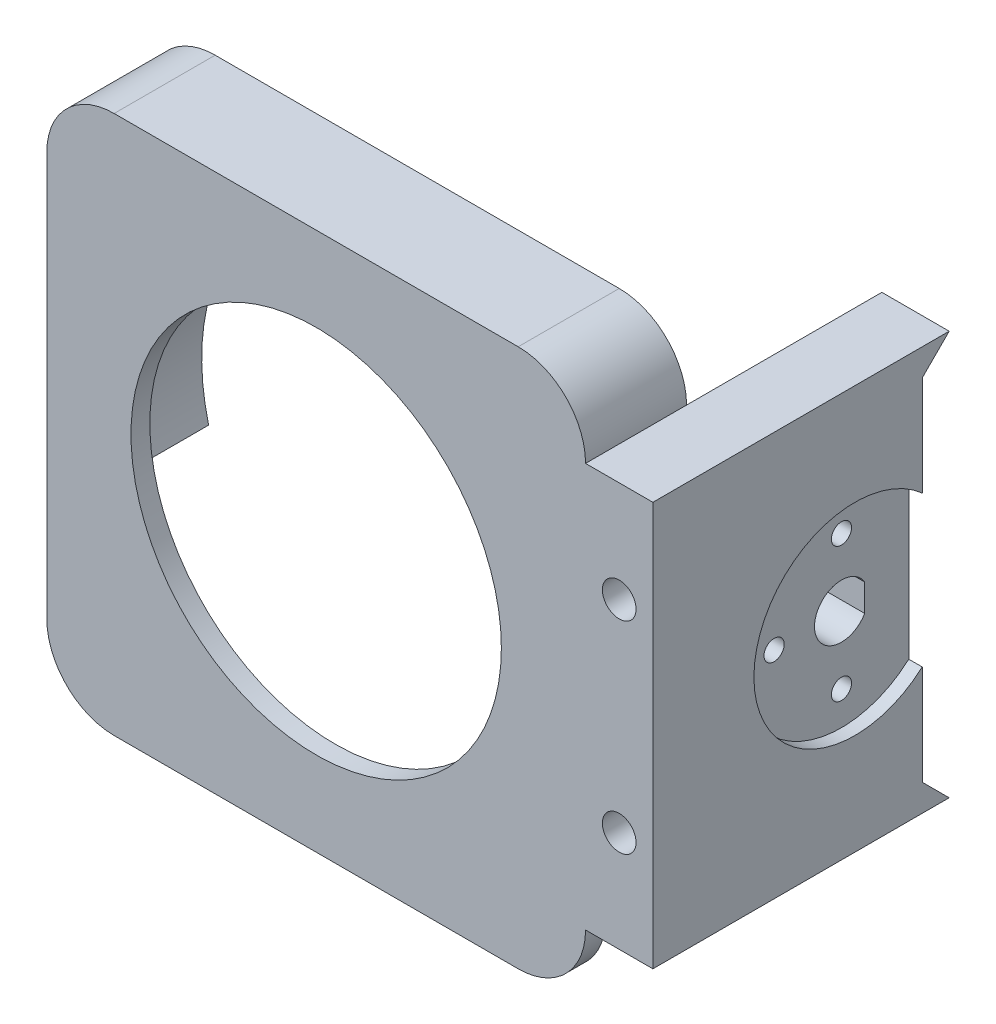
ISO-10303-21;
HEADER;
FILE_DESCRIPTION(('STEP AP214'),'2;1');
FILE_NAME('part.step','',(''),(''),'','','');
FILE_SCHEMA(('AUTOMOTIVE_DESIGN { 1 0 10303 214 1 1 1 1 }'));
ENDSEC;
DATA;
#1=APPLICATION_CONTEXT('core data for automotive mechanical design processes');
#2=APPLICATION_PROTOCOL_DEFINITION('international standard','automotive_design',2000,#1);
#3=PRODUCT_CONTEXT('',#1,'mechanical');
#4=PRODUCT('Part','Part','',(#3));
#5=PRODUCT_RELATED_PRODUCT_CATEGORY('part','',(#4));
#6=PRODUCT_DEFINITION_FORMATION('','',#4);
#7=PRODUCT_DEFINITION_CONTEXT('part definition',#1,'design');
#8=PRODUCT_DEFINITION('design','',#6,#7);
#9=PRODUCT_DEFINITION_SHAPE('','',#8);
#10=(LENGTH_UNIT() NAMED_UNIT(*) SI_UNIT(.MILLI.,.METRE.));
#11=(NAMED_UNIT(*) PLANE_ANGLE_UNIT() SI_UNIT($,.RADIAN.));
#12=(NAMED_UNIT(*) SI_UNIT($,.STERADIAN.) SOLID_ANGLE_UNIT());
#13=UNCERTAINTY_MEASURE_WITH_UNIT(LENGTH_MEASURE(1.E-05),#10,'distance_accuracy_value','');
#14=(GEOMETRIC_REPRESENTATION_CONTEXT(3) GLOBAL_UNCERTAINTY_ASSIGNED_CONTEXT((#13)) GLOBAL_UNIT_ASSIGNED_CONTEXT((#10,
#11,#12)) REPRESENTATION_CONTEXT('',''));
#15=CARTESIAN_POINT('',(0.,0.,0.));
#16=DIRECTION('',(0.,0.,1.));
#17=DIRECTION('',(1.,0.,0.));
#18=AXIS2_PLACEMENT_3D('',#15,#16,#17);
#19=CARTESIAN_POINT('',(0.,0.,0.));
#20=DIRECTION('',(0.,0.,-1.));
#21=DIRECTION('',(-1.,0.,0.));
#22=AXIS2_PLACEMENT_3D('',#19,#20,#21);
#23=PLANE('',#22);
#24=CARTESIAN_POINT('',(40.,40.,0.));
#25=DIRECTION('',(0.,0.,1.));
#26=DIRECTION('',(1.,0.,0.));
#27=AXIS2_PLACEMENT_3D('',#24,#25,#26);
#28=CIRCLE('',#27,32.);
#29=CARTESIAN_POINT('',(70.9677419354839,31.9378067861608,0.));
#30=VERTEX_POINT('',#29);
#31=CARTESIAN_POINT('',(9.03225806451613,31.9378067861608,0.));
#32=VERTEX_POINT('',#31);
#33=EDGE_CURVE('E356',#30,#32,#28,.T.);
#34=ORIENTED_EDGE('',*,*,#33,.T.);
#35=DIRECTION('',(-1.,0.,0.));
#36=VECTOR('',#35,1.);
#37=CARTESIAN_POINT('',(0.,31.9378067861608,0.));
#38=LINE('',#37,#36);
#39=CARTESIAN_POINT('',(0.,31.9378067861608,0.));
#40=VERTEX_POINT('',#39);
#41=EDGE_CURVE('E191',#32,#40,#38,.T.);
#42=ORIENTED_EDGE('',*,*,#41,.T.);
#43=DIRECTION('',(0.,-1.,0.));
#44=VECTOR('',#43,1.);
#45=CARTESIAN_POINT('',(0.,0.,0.));
#46=LINE('',#45,#44);
#47=CARTESIAN_POINT('',(0.,70.,0.));
#48=VERTEX_POINT('',#47);
#49=EDGE_CURVE('E359',#48,#40,#46,.T.);
#50=ORIENTED_EDGE('',*,*,#49,.F.);
#51=CARTESIAN_POINT('',(10.,70.,0.));
#52=DIRECTION('',(0.,0.,-1.));
#53=DIRECTION('',(-1.,0.,0.));
#54=AXIS2_PLACEMENT_3D('',#51,#52,#53);
#55=CIRCLE('',#54,10.);
#56=CARTESIAN_POINT('',(10.,80.,0.));
#57=VERTEX_POINT('',#56);
#58=EDGE_CURVE('E394',#48,#57,#55,.T.);
#59=ORIENTED_EDGE('',*,*,#58,.T.);
#60=DIRECTION('',(-1.,0.,0.));
#61=VECTOR('',#60,1.);
#62=CARTESIAN_POINT('',(0.,80.,0.));
#63=LINE('',#62,#61);
#64=CARTESIAN_POINT('',(70.,80.,0.));
#65=VERTEX_POINT('',#64);
#66=EDGE_CURVE('E365',#65,#57,#63,.T.);
#67=ORIENTED_EDGE('',*,*,#66,.F.);
#68=CARTESIAN_POINT('',(70.,70.,0.));
#69=DIRECTION('',(0.,0.,-1.));
#70=DIRECTION('',(-1.,0.,0.));
#71=AXIS2_PLACEMENT_3D('',#68,#69,#70);
#72=CIRCLE('',#71,10.);
#73=CARTESIAN_POINT('',(80.,70.,0.));
#74=VERTEX_POINT('',#73);
#75=EDGE_CURVE('E390',#65,#74,#72,.T.);
#76=ORIENTED_EDGE('',*,*,#75,.T.);
#77=DIRECTION('',(0.,1.,0.));
#78=VECTOR('',#77,1.);
#79=CARTESIAN_POINT('',(80.,0.,0.));
#80=LINE('',#79,#78);
#81=CARTESIAN_POINT('',(80.,31.9378067861608,0.));
#82=VERTEX_POINT('',#81);
#83=EDGE_CURVE('E377',#82,#74,#80,.T.);
#84=ORIENTED_EDGE('',*,*,#83,.F.);
#85=DIRECTION('',(1.,0.,0.));
#86=VECTOR('',#85,1.);
#87=CARTESIAN_POINT('',(0.,31.9378067861608,0.));
#88=LINE('',#87,#86);
#89=EDGE_CURVE('E548',#30,#82,#88,.T.);
#90=ORIENTED_EDGE('',*,*,#89,.F.);
#91=EDGE_LOOP('',(#34,#42,#50,#59,#67,#76,#84,#90));
#92=FACE_BOUND('',#91,.T.);
#93=ADVANCED_FACE('F41',(#92),#23,.T.);
#94=CARTESIAN_POINT('',(0.,0.,15.));
#95=DIRECTION('',(1.,0.,0.));
#96=DIRECTION('',(0.,0.,-1.));
#97=AXIS2_PLACEMENT_3D('',#94,#95,#96);
#98=PLANE('',#97);
#99=DIRECTION('',(0.,0.,-1.));
#100=VECTOR('',#99,1.);
#101=CARTESIAN_POINT('',(0.,31.9378067861608,12.));
#102=LINE('',#101,#100);
#103=CARTESIAN_POINT('',(0.,31.9378067861608,12.));
#104=VERTEX_POINT('',#103);
#105=EDGE_CURVE('E535',#104,#40,#102,.T.);
#106=ORIENTED_EDGE('',*,*,#105,.F.);
#107=DIRECTION('',(0.,1.,0.));
#108=VECTOR('',#107,1.);
#109=CARTESIAN_POINT('',(0.,0.,12.));
#110=LINE('',#109,#108);
#111=CARTESIAN_POINT('',(0.,9.99999999999993,12.));
#112=VERTEX_POINT('',#111);
#113=EDGE_CURVE('E202',#112,#104,#110,.T.);
#114=ORIENTED_EDGE('',*,*,#113,.F.);
#115=DIRECTION('',(0.,0.,-1.));
#116=VECTOR('',#115,1.);
#117=CARTESIAN_POINT('',(0.,10.,15.));
#118=LINE('',#117,#116);
#119=CARTESIAN_POINT('',(0.,10.,15.));
#120=VERTEX_POINT('',#119);
#121=EDGE_CURVE('E420',#112,#120,#118,.F.);
#122=ORIENTED_EDGE('',*,*,#121,.T.);
#123=DIRECTION('',(0.,-1.,0.));
#124=VECTOR('',#123,1.);
#125=CARTESIAN_POINT('',(0.,0.,15.));
#126=LINE('',#125,#124);
#127=CARTESIAN_POINT('',(0.,70.,15.));
#128=VERTEX_POINT('',#127);
#129=EDGE_CURVE('E360',#128,#120,#126,.T.);
#130=ORIENTED_EDGE('',*,*,#129,.F.);
#131=DIRECTION('',(0.,0.,-1.));
#132=VECTOR('',#131,1.);
#133=CARTESIAN_POINT('',(0.,70.,15.));
#134=LINE('',#133,#132);
#135=EDGE_CURVE('E416',#128,#48,#134,.T.);
#136=ORIENTED_EDGE('',*,*,#135,.T.);
#137=ORIENTED_EDGE('',*,*,#49,.T.);
#138=EDGE_LOOP('',(#106,#114,#122,#130,#136,#137));
#139=FACE_BOUND('',#138,.T.);
#140=ADVANCED_FACE('F462',(#139),#98,.F.);
#141=CARTESIAN_POINT('',(70.,10.,15.));
#142=DIRECTION('',(0.,0.,-1.));
#143=DIRECTION('',(-1.,0.,0.));
#144=AXIS2_PLACEMENT_3D('',#141,#142,#143);
#145=CYLINDRICAL_SURFACE('',#144,10.);
#146=DIRECTION('',(0.,0.,-1.));
#147=VECTOR('',#146,1.);
#148=CARTESIAN_POINT('',(70.,0.,15.));
#149=LINE('',#148,#147);
#150=CARTESIAN_POINT('',(70.,0.,12.));
#151=VERTEX_POINT('',#150);
#152=CARTESIAN_POINT('',(70.,0.,15.));
#153=VERTEX_POINT('',#152);
#154=EDGE_CURVE('E401',#151,#153,#149,.F.);
#155=ORIENTED_EDGE('',*,*,#154,.F.);
#156=CARTESIAN_POINT('',(70.,10.,12.));
#157=DIRECTION('',(0.,0.,-1.));
#158=DIRECTION('',(-1.,0.,0.));
#159=AXIS2_PLACEMENT_3D('',#156,#157,#158);
#160=CIRCLE('',#159,10.);
#161=CARTESIAN_POINT('',(80.,9.99999999999993,12.));
#162=VERTEX_POINT('',#161);
#163=EDGE_CURVE('E517',#151,#162,#160,.F.);
#164=ORIENTED_EDGE('',*,*,#163,.T.);
#165=DIRECTION('',(0.,0.,-1.));
#166=VECTOR('',#165,1.);
#167=CARTESIAN_POINT('',(80.,10.,15.));
#168=LINE('',#167,#166);
#169=CARTESIAN_POINT('',(80.,10.,15.));
#170=VERTEX_POINT('',#169);
#171=EDGE_CURVE('E386',#170,#162,#168,.T.);
#172=ORIENTED_EDGE('',*,*,#171,.F.);
#173=CARTESIAN_POINT('',(70.,10.,15.));
#174=DIRECTION('',(0.,0.,-1.));
#175=DIRECTION('',(-1.,0.,0.));
#176=AXIS2_PLACEMENT_3D('',#173,#174,#175);
#177=CIRCLE('',#176,10.);
#178=EDGE_CURVE('E413',#153,#170,#177,.F.);
#179=ORIENTED_EDGE('',*,*,#178,.F.);
#180=EDGE_LOOP('',(#155,#164,#172,#179));
#181=FACE_BOUND('',#180,.T.);
#182=ADVANCED_FACE('F468',(#181),#145,.T.);
#183=CARTESIAN_POINT('',(10.,10.,15.));
#184=DIRECTION('',(0.,0.,-1.));
#185=DIRECTION('',(-1.,0.,0.));
#186=AXIS2_PLACEMENT_3D('',#183,#184,#185);
#187=CYLINDRICAL_SURFACE('',#186,10.);
#188=ORIENTED_EDGE('',*,*,#121,.F.);
#189=CARTESIAN_POINT('',(10.,10.,12.));
#190=DIRECTION('',(0.,0.,1.));
#191=DIRECTION('',(1.,0.,0.));
#192=AXIS2_PLACEMENT_3D('',#189,#190,#191);
#193=CIRCLE('',#192,10.);
#194=CARTESIAN_POINT('',(10.,0.,12.));
#195=VERTEX_POINT('',#194);
#196=EDGE_CURVE('E11',#195,#112,#193,.F.);
#197=ORIENTED_EDGE('',*,*,#196,.F.);
#198=DIRECTION('',(0.,0.,-1.));
#199=VECTOR('',#198,1.);
#200=CARTESIAN_POINT('',(10.,0.,15.));
#201=LINE('',#200,#199);
#202=CARTESIAN_POINT('',(10.,0.,15.));
#203=VERTEX_POINT('',#202);
#204=EDGE_CURVE('E397',#203,#195,#201,.T.);
#205=ORIENTED_EDGE('',*,*,#204,.F.);
#206=CARTESIAN_POINT('',(10.,10.,15.));
#207=DIRECTION('',(0.,0.,-1.));
#208=DIRECTION('',(-1.,0.,0.));
#209=AXIS2_PLACEMENT_3D('',#206,#207,#208);
#210=CIRCLE('',#209,10.);
#211=EDGE_CURVE('E410',#120,#203,#210,.F.);
#212=ORIENTED_EDGE('',*,*,#211,.F.);
#213=EDGE_LOOP('',(#188,#197,#205,#212));
#214=FACE_BOUND('',#213,.T.);
#215=ADVANCED_FACE('F484',(#214),#187,.T.);
#216=CARTESIAN_POINT('',(80.,40.,-15.));
#217=DIRECTION('',(1.,0.,0.));
#218=DIRECTION('',(0.,0.,-1.));
#219=AXIS2_PLACEMENT_3D('',#216,#217,#218);
#220=CYLINDRICAL_SURFACE('',#219,4.);
#221=CARTESIAN_POINT('',(88.,40.,-15.));
#222=DIRECTION('',(1.,0.,0.));
#223=DIRECTION('',(0.,0.,-1.));
#224=AXIS2_PLACEMENT_3D('',#221,#222,#223);
#225=CIRCLE('',#224,4.);
#226=CARTESIAN_POINT('',(88.,37.9787216202429,-18.4517290901121));
#227=VERTEX_POINT('',#226);
#228=CARTESIAN_POINT('',(88.,42.0212783797572,-18.4517290901121));
#229=VERTEX_POINT('',#228);
#230=EDGE_CURVE('E233',#227,#229,#225,.F.);
#231=ORIENTED_EDGE('',*,*,#230,.F.);
#232=DIRECTION('',(1.,0.,0.));
#233=VECTOR('',#232,1.);
#234=CARTESIAN_POINT('',(80.,37.9787216202429,-18.4517290901121));
#235=LINE('',#234,#233);
#236=CARTESIAN_POINT('',(80.,37.9787216202429,-18.4517290901121));
#237=VERTEX_POINT('',#236);
#238=EDGE_CURVE('E255',#237,#227,#235,.T.);
#239=ORIENTED_EDGE('',*,*,#238,.F.);
#240=CARTESIAN_POINT('',(80.,40.,-15.));
#241=DIRECTION('',(1.,0.,0.));
#242=DIRECTION('',(0.,0.,-1.));
#243=AXIS2_PLACEMENT_3D('',#240,#241,#242);
#244=CIRCLE('',#243,4.);
#245=CARTESIAN_POINT('',(80.,42.0212783797572,-18.4517290901121));
#246=VERTEX_POINT('',#245);
#247=EDGE_CURVE('E246',#246,#237,#244,.T.);
#248=ORIENTED_EDGE('',*,*,#247,.F.);
#249=DIRECTION('',(1.,0.,0.));
#250=VECTOR('',#249,1.);
#251=CARTESIAN_POINT('',(80.,42.0212783797572,-18.4517290901121));
#252=LINE('',#251,#250);
#253=EDGE_CURVE('E256',#246,#229,#252,.T.);
#254=ORIENTED_EDGE('',*,*,#253,.T.);
#255=EDGE_LOOP('',(#231,#239,#248,#254));
#256=FACE_BOUND('',#255,.T.);
#257=ADVANCED_FACE('F487',(#256),#220,.F.);
#258=CARTESIAN_POINT('',(80.,42.0212783797572,-18.4517290901121));
#259=DIRECTION('',(0.,0.,-1.));
#260=DIRECTION('',(-1.,0.,0.));
#261=AXIS2_PLACEMENT_3D('',#258,#259,#260);
#262=PLANE('',#261);
#263=DIRECTION('',(0.,-1.,0.));
#264=VECTOR('',#263,1.);
#265=CARTESIAN_POINT('',(88.,42.0212783797572,-18.4517290901121));
#266=LINE('',#265,#264);
#267=EDGE_CURVE('E230',#229,#227,#266,.T.);
#268=ORIENTED_EDGE('',*,*,#267,.F.);
#269=ORIENTED_EDGE('',*,*,#253,.F.);
#270=DIRECTION('',(0.,1.,0.));
#271=VECTOR('',#270,1.);
#272=CARTESIAN_POINT('',(80.,42.0212783797572,-18.4517290901121));
#273=LINE('',#272,#271);
#274=EDGE_CURVE('E250',#237,#246,#273,.T.);
#275=ORIENTED_EDGE('',*,*,#274,.F.);
#276=ORIENTED_EDGE('',*,*,#238,.T.);
#277=EDGE_LOOP('',(#268,#269,#275,#276));
#278=FACE_BOUND('',#277,.T.);
#279=ADVANCED_FACE('F722',(#278),#262,.F.);
#280=CARTESIAN_POINT('',(60.,30.,-15.));
#281=DIRECTION('',(1.,0.,0.));
#282=DIRECTION('',(0.,0.,-1.));
#283=AXIS2_PLACEMENT_3D('',#280,#281,#282);
#284=CYLINDRICAL_SURFACE('',#283,1.5);
#285=CARTESIAN_POINT('',(80.,30.,-15.));
#286=DIRECTION('',(1.,0.,0.));
#287=DIRECTION('',(0.,0.,-1.));
#288=AXIS2_PLACEMENT_3D('',#285,#286,#287);
#289=CIRCLE('',#288,1.5);
#290=CARTESIAN_POINT('',(80.,30.,-16.5));
#291=VERTEX_POINT('',#290);
#292=EDGE_CURVE('E245',#291,#291,#289,.T.);
#293=ORIENTED_EDGE('',*,*,#292,.F.);
#294=EDGE_LOOP('',(#293));
#295=FACE_BOUND('',#294,.T.);
#296=CARTESIAN_POINT('',(88.,30.,-15.));
#297=DIRECTION('',(1.,0.,0.));
#298=DIRECTION('',(0.,0.,-1.));
#299=AXIS2_PLACEMENT_3D('',#296,#297,#298);
#300=CIRCLE('',#299,1.5);
#301=CARTESIAN_POINT('',(88.,30.,-16.5));
#302=VERTEX_POINT('',#301);
#303=EDGE_CURVE('E226',#302,#302,#300,.F.);
#304=ORIENTED_EDGE('',*,*,#303,.F.);
#305=EDGE_LOOP('',(#304));
#306=FACE_BOUND('',#305,.T.);
#307=ADVANCED_FACE('F456',(#295,#306),#284,.F.);
#308=CARTESIAN_POINT('',(60.,50.,-15.));
#309=DIRECTION('',(1.,0.,0.));
#310=DIRECTION('',(0.,0.,-1.));
#311=AXIS2_PLACEMENT_3D('',#308,#309,#310);
#312=CYLINDRICAL_SURFACE('',#311,1.5);
#313=CARTESIAN_POINT('',(80.,50.,-15.));
#314=DIRECTION('',(1.,0.,0.));
#315=DIRECTION('',(0.,0.,-1.));
#316=AXIS2_PLACEMENT_3D('',#313,#314,#315);
#317=CIRCLE('',#316,1.5);
#318=CARTESIAN_POINT('',(80.,50.,-16.5));
#319=VERTEX_POINT('',#318);
#320=EDGE_CURVE('E432',#319,#319,#317,.T.);
#321=ORIENTED_EDGE('',*,*,#320,.F.);
#322=EDGE_LOOP('',(#321));
#323=FACE_BOUND('',#322,.T.);
#324=CARTESIAN_POINT('',(88.,50.,-15.));
#325=DIRECTION('',(1.,0.,0.));
#326=DIRECTION('',(0.,0.,-1.));
#327=AXIS2_PLACEMENT_3D('',#324,#325,#326);
#328=CIRCLE('',#327,1.5);
#329=CARTESIAN_POINT('',(88.,50.,-16.5));
#330=VERTEX_POINT('',#329);
#331=EDGE_CURVE('E222',#330,#330,#328,.F.);
#332=ORIENTED_EDGE('',*,*,#331,.F.);
#333=EDGE_LOOP('',(#332));
#334=FACE_BOUND('',#333,.T.);
#335=ADVANCED_FACE('F447',(#323,#334),#312,.F.);
#336=CARTESIAN_POINT('',(60.,40.,-4.99999999999999));
#337=DIRECTION('',(1.,0.,0.));
#338=DIRECTION('',(0.,0.,-1.));
#339=AXIS2_PLACEMENT_3D('',#336,#337,#338);
#340=CYLINDRICAL_SURFACE('',#339,1.5);
#341=CARTESIAN_POINT('',(80.,40.,-4.99999999999999));
#342=DIRECTION('',(1.,0.,0.));
#343=DIRECTION('',(0.,0.,-1.));
#344=AXIS2_PLACEMENT_3D('',#341,#342,#343);
#345=CIRCLE('',#344,1.5);
#346=CARTESIAN_POINT('',(80.,40.,-6.49999999999999));
#347=VERTEX_POINT('',#346);
#348=EDGE_CURVE('E251',#347,#347,#345,.T.);
#349=ORIENTED_EDGE('',*,*,#348,.F.);
#350=EDGE_LOOP('',(#349));
#351=FACE_BOUND('',#350,.T.);
#352=CARTESIAN_POINT('',(88.,40.,-4.99999999999999));
#353=DIRECTION('',(1.,0.,0.));
#354=DIRECTION('',(0.,0.,-1.));
#355=AXIS2_PLACEMENT_3D('',#352,#353,#354);
#356=CIRCLE('',#355,1.5);
#357=CARTESIAN_POINT('',(88.,40.,-6.49999999999999));
#358=VERTEX_POINT('',#357);
#359=EDGE_CURVE('E220',#358,#358,#356,.F.);
#360=ORIENTED_EDGE('',*,*,#359,.F.);
#361=EDGE_LOOP('',(#360));
#362=FACE_BOUND('',#361,.T.);
#363=ADVANCED_FACE('F445',(#351,#362),#340,.F.);
#364=CARTESIAN_POINT('',(40.,40.,15.));
#365=DIRECTION('',(0.,0.,-1.));
#366=DIRECTION('',(-1.,0.,0.));
#367=AXIS2_PLACEMENT_3D('',#364,#365,#366);
#368=CYLINDRICAL_SURFACE('',#367,32.);
#369=DIRECTION('',(0.,0.,-1.));
#370=VECTOR('',#369,1.);
#371=CARTESIAN_POINT('',(70.9677419354839,31.9378067861608,12.));
#372=LINE('',#371,#370);
#373=CARTESIAN_POINT('',(70.9677419354839,31.9378067861608,12.));
#374=VERTEX_POINT('',#373);
#375=EDGE_CURVE('E209',#374,#30,#372,.T.);
#376=ORIENTED_EDGE('',*,*,#375,.F.);
#377=CARTESIAN_POINT('',(40.,40.,12.));
#378=DIRECTION('',(0.,0.,1.));
#379=DIRECTION('',(1.,0.,0.));
#380=AXIS2_PLACEMENT_3D('',#377,#378,#379);
#381=CIRCLE('',#380,32.);
#382=CARTESIAN_POINT('',(9.03225806451613,31.9378067861608,12.));
#383=VERTEX_POINT('',#382);
#384=EDGE_CURVE('E197',#383,#374,#381,.T.);
#385=ORIENTED_EDGE('',*,*,#384,.F.);
#386=DIRECTION('',(0.,0.,-1.));
#387=VECTOR('',#386,1.);
#388=CARTESIAN_POINT('',(9.03225806451613,31.9378067861608,12.));
#389=LINE('',#388,#387);
#390=EDGE_CURVE('E185',#383,#32,#389,.T.);
#391=ORIENTED_EDGE('',*,*,#390,.T.);
#392=ORIENTED_EDGE('',*,*,#33,.F.);
#393=EDGE_LOOP('',(#376,#385,#391,#392));
#394=FACE_BOUND('',#393,.T.);
#395=CARTESIAN_POINT('',(40.,40.,12.2));
#396=DIRECTION('',(0.,0.,1.));
#397=DIRECTION('',(1.,0.,0.));
#398=AXIS2_PLACEMENT_3D('',#395,#396,#397);
#399=CIRCLE('',#398,32.);
#400=CARTESIAN_POINT('',(72.,40.,12.2));
#401=VERTEX_POINT('',#400);
#402=EDGE_CURVE('E349',#401,#401,#399,.T.);
#403=ORIENTED_EDGE('',*,*,#402,.T.);
#404=EDGE_LOOP('',(#403));
#405=FACE_BOUND('',#404,.T.);
#406=ADVANCED_FACE('F207',(#394,#405),#368,.F.);
#407=CARTESIAN_POINT('',(0.,0.,15.));
#408=DIRECTION('',(0.,0.,-1.));
#409=DIRECTION('',(-1.,0.,0.));
#410=AXIS2_PLACEMENT_3D('',#407,#408,#409);
#411=PLANE('',#410);
#412=CARTESIAN_POINT('',(85.,55.,15.));
#413=DIRECTION('',(0.,0.,-1.));
#414=DIRECTION('',(0.,1.,0.));
#415=AXIS2_PLACEMENT_3D('',#412,#413,#414);
#416=CIRCLE('',#415,2.5);
#417=CARTESIAN_POINT('',(85.,57.5,15.));
#418=VERTEX_POINT('',#417);
#419=EDGE_CURVE('E296',#418,#418,#416,.T.);
#420=ORIENTED_EDGE('',*,*,#419,.T.);
#421=EDGE_LOOP('',(#420));
#422=FACE_BOUND('',#421,.T.);
#423=CARTESIAN_POINT('',(85.,25.,15.));
#424=DIRECTION('',(0.,0.,-1.));
#425=DIRECTION('',(0.,-1.,0.));
#426=AXIS2_PLACEMENT_3D('',#423,#424,#425);
#427=CIRCLE('',#426,2.5);
#428=CARTESIAN_POINT('',(85.,22.5,15.));
#429=VERTEX_POINT('',#428);
#430=EDGE_CURVE('E305',#429,#429,#427,.T.);
#431=ORIENTED_EDGE('',*,*,#430,.T.);
#432=EDGE_LOOP('',(#431));
#433=FACE_BOUND('',#432,.T.);
#434=DIRECTION('',(1.,0.,0.));
#435=VECTOR('',#434,1.);
#436=CARTESIAN_POINT('',(0.,0.,15.));
#437=LINE('',#436,#435);
#438=EDGE_CURVE('E364',#203,#153,#437,.T.);
#439=ORIENTED_EDGE('',*,*,#438,.T.);
#440=ORIENTED_EDGE('',*,*,#178,.T.);
#441=DIRECTION('',(-1.,0.,0.));
#442=VECTOR('',#441,1.);
#443=CARTESIAN_POINT('',(90.,10.,15.));
#444=LINE('',#443,#442);
#445=CARTESIAN_POINT('',(90.,10.,15.));
#446=VERTEX_POINT('',#445);
#447=EDGE_CURVE('E340',#446,#170,#444,.T.);
#448=ORIENTED_EDGE('',*,*,#447,.F.);
#449=DIRECTION('',(0.,-1.,0.));
#450=VECTOR('',#449,1.);
#451=CARTESIAN_POINT('',(90.,70.,15.));
#452=LINE('',#451,#450);
#453=CARTESIAN_POINT('',(90.,70.,15.));
#454=VERTEX_POINT('',#453);
#455=EDGE_CURVE('E312',#454,#446,#452,.T.);
#456=ORIENTED_EDGE('',*,*,#455,.F.);
#457=DIRECTION('',(-1.,0.,0.));
#458=VECTOR('',#457,1.);
#459=CARTESIAN_POINT('',(90.,70.,15.));
#460=LINE('',#459,#458);
#461=CARTESIAN_POINT('',(80.,70.,15.));
#462=VERTEX_POINT('',#461);
#463=EDGE_CURVE('E328',#454,#462,#460,.T.);
#464=ORIENTED_EDGE('',*,*,#463,.T.);
#465=CARTESIAN_POINT('',(70.,70.,15.));
#466=DIRECTION('',(0.,0.,-1.));
#467=DIRECTION('',(-1.,0.,0.));
#468=AXIS2_PLACEMENT_3D('',#465,#466,#467);
#469=CIRCLE('',#468,10.);
#470=CARTESIAN_POINT('',(70.,80.,15.));
#471=VERTEX_POINT('',#470);
#472=EDGE_CURVE('E404',#462,#471,#469,.F.);
#473=ORIENTED_EDGE('',*,*,#472,.T.);
#474=DIRECTION('',(-1.,0.,0.));
#475=VECTOR('',#474,1.);
#476=CARTESIAN_POINT('',(0.,80.,15.));
#477=LINE('',#476,#475);
#478=CARTESIAN_POINT('',(10.,80.,15.));
#479=VERTEX_POINT('',#478);
#480=EDGE_CURVE('E369',#471,#479,#477,.T.);
#481=ORIENTED_EDGE('',*,*,#480,.T.);
#482=CARTESIAN_POINT('',(10.,70.,15.));
#483=DIRECTION('',(0.,0.,-1.));
#484=DIRECTION('',(-1.,0.,0.));
#485=AXIS2_PLACEMENT_3D('',#482,#483,#484);
#486=CIRCLE('',#485,10.);
#487=EDGE_CURVE('E407',#479,#128,#486,.F.);
#488=ORIENTED_EDGE('',*,*,#487,.T.);
#489=ORIENTED_EDGE('',*,*,#129,.T.);
#490=ORIENTED_EDGE('',*,*,#211,.T.);
#491=EDGE_LOOP('',(#439,#440,#448,#456,#464,#473,#481,#488,#489,#490));
#492=FACE_BOUND('',#491,.T.);
#493=CARTESIAN_POINT('',(40.,40.,15.));
#494=DIRECTION('',(0.,0.,1.));
#495=DIRECTION('',(1.,0.,0.));
#496=AXIS2_PLACEMENT_3D('',#493,#494,#495);
#497=CIRCLE('',#496,27.5);
#498=CARTESIAN_POINT('',(67.5,40.,15.));
#499=VERTEX_POINT('',#498);
#500=EDGE_CURVE('E344',#499,#499,#497,.T.);
#501=ORIENTED_EDGE('',*,*,#500,.F.);
#502=EDGE_LOOP('',(#501));
#503=FACE_BOUND('',#502,.T.);
#504=ADVANCED_FACE('F454',(#422,#433,#492,#503),#411,.F.);
#505=CARTESIAN_POINT('',(0.,0.,15.));
#506=DIRECTION('',(0.,1.,0.));
#507=DIRECTION('',(0.,0.,1.));
#508=AXIS2_PLACEMENT_3D('',#505,#506,#507);
#509=PLANE('',#508);
#510=ORIENTED_EDGE('',*,*,#204,.T.);
#511=DIRECTION('',(-1.,0.,0.));
#512=VECTOR('',#511,1.);
#513=CARTESIAN_POINT('',(70.,0.,12.));
#514=LINE('',#513,#512);
#515=EDGE_CURVE('E56',#151,#195,#514,.T.);
#516=ORIENTED_EDGE('',*,*,#515,.F.);
#517=ORIENTED_EDGE('',*,*,#154,.T.);
#518=ORIENTED_EDGE('',*,*,#438,.F.);
#519=EDGE_LOOP('',(#510,#516,#517,#518));
#520=FACE_BOUND('',#519,.T.);
#521=ADVANCED_FACE('F477',(#520),#509,.F.);
#522=CARTESIAN_POINT('',(0.,80.,15.));
#523=DIRECTION('',(0.,-1.,0.));
#524=DIRECTION('',(0.,0.,-1.));
#525=AXIS2_PLACEMENT_3D('',#522,#523,#524);
#526=PLANE('',#525);
#527=ORIENTED_EDGE('',*,*,#66,.T.);
#528=DIRECTION('',(0.,0.,-1.));
#529=VECTOR('',#528,1.);
#530=CARTESIAN_POINT('',(10.,80.,15.));
#531=LINE('',#530,#529);
#532=EDGE_CURVE('E50',#57,#479,#531,.F.);
#533=ORIENTED_EDGE('',*,*,#532,.T.);
#534=ORIENTED_EDGE('',*,*,#480,.F.);
#535=DIRECTION('',(0.,0.,-1.));
#536=VECTOR('',#535,1.);
#537=CARTESIAN_POINT('',(70.,80.,15.));
#538=LINE('',#537,#536);
#539=EDGE_CURVE('E423',#471,#65,#538,.T.);
#540=ORIENTED_EDGE('',*,*,#539,.T.);
#541=EDGE_LOOP('',(#527,#533,#534,#540));
#542=FACE_BOUND('',#541,.T.);
#543=ADVANCED_FACE('F473',(#542),#526,.F.);
#544=CARTESIAN_POINT('',(40.,40.,12.2));
#545=DIRECTION('',(0.,0.,1.));
#546=DIRECTION('',(1.,0.,0.));
#547=AXIS2_PLACEMENT_3D('',#544,#545,#546);
#548=PLANE('',#547);
#549=CARTESIAN_POINT('',(40.,40.,12.2));
#550=DIRECTION('',(0.,0.,1.));
#551=DIRECTION('',(1.,0.,0.));
#552=AXIS2_PLACEMENT_3D('',#549,#550,#551);
#553=CIRCLE('',#552,27.5);
#554=CARTESIAN_POINT('',(67.5,40.,12.2));
#555=VERTEX_POINT('',#554);
#556=EDGE_CURVE('E345',#555,#555,#553,.T.);
#557=ORIENTED_EDGE('',*,*,#556,.T.);
#558=EDGE_LOOP('',(#557));
#559=FACE_BOUND('',#558,.T.);
#560=ORIENTED_EDGE('',*,*,#402,.F.);
#561=EDGE_LOOP('',(#560));
#562=FACE_BOUND('',#561,.T.);
#563=ADVANCED_FACE('F476',(#559,#562),#548,.F.);
#564=CARTESIAN_POINT('',(40.,40.,12.2));
#565=DIRECTION('',(0.,0.,1.));
#566=DIRECTION('',(1.,0.,0.));
#567=AXIS2_PLACEMENT_3D('',#564,#565,#566);
#568=CYLINDRICAL_SURFACE('',#567,27.5);
#569=ORIENTED_EDGE('',*,*,#556,.F.);
#570=EDGE_LOOP('',(#569));
#571=FACE_BOUND('',#570,.T.);
#572=ORIENTED_EDGE('',*,*,#500,.T.);
#573=EDGE_LOOP('',(#572));
#574=FACE_BOUND('',#573,.T.);
#575=ADVANCED_FACE('F491',(#571,#574),#568,.F.);
#576=CARTESIAN_POINT('',(10.,70.,15.));
#577=DIRECTION('',(0.,0.,-1.));
#578=DIRECTION('',(-1.,0.,0.));
#579=AXIS2_PLACEMENT_3D('',#576,#577,#578);
#580=CYLINDRICAL_SURFACE('',#579,10.);
#581=ORIENTED_EDGE('',*,*,#487,.F.);
#582=ORIENTED_EDGE('',*,*,#532,.F.);
#583=ORIENTED_EDGE('',*,*,#58,.F.);
#584=ORIENTED_EDGE('',*,*,#135,.F.);
#585=EDGE_LOOP('',(#581,#582,#583,#584));
#586=FACE_BOUND('',#585,.T.);
#587=ADVANCED_FACE('F489',(#586),#580,.T.);
#588=CARTESIAN_POINT('',(70.,70.,15.));
#589=DIRECTION('',(0.,0.,-1.));
#590=DIRECTION('',(-1.,0.,0.));
#591=AXIS2_PLACEMENT_3D('',#588,#589,#590);
#592=CYLINDRICAL_SURFACE('',#591,10.);
#593=ORIENTED_EDGE('',*,*,#472,.F.);
#594=DIRECTION('',(0.,0.,-1.));
#595=VECTOR('',#594,1.);
#596=CARTESIAN_POINT('',(80.,70.,15.));
#597=LINE('',#596,#595);
#598=EDGE_CURVE('E373',#74,#462,#597,.F.);
#599=ORIENTED_EDGE('',*,*,#598,.F.);
#600=ORIENTED_EDGE('',*,*,#75,.F.);
#601=ORIENTED_EDGE('',*,*,#539,.F.);
#602=EDGE_LOOP('',(#593,#599,#600,#601));
#603=FACE_BOUND('',#602,.T.);
#604=ADVANCED_FACE('F43',(#603),#592,.T.);
#605=CARTESIAN_POINT('',(90.,10.,15.));
#606=DIRECTION('',(0.,1.,0.));
#607=DIRECTION('',(0.,0.,1.));
#608=AXIS2_PLACEMENT_3D('',#605,#606,#607);
#609=PLANE('',#608);
#610=ORIENTED_EDGE('',*,*,#171,.T.);
#611=DIRECTION('',(0.,0.,-1.));
#612=VECTOR('',#611,1.);
#613=CARTESIAN_POINT('',(80.,10.,15.));
#614=LINE('',#613,#612);
#615=CARTESIAN_POINT('',(80.,9.99999999999998,-29.));
#616=VERTEX_POINT('',#615);
#617=EDGE_CURVE('E300',#162,#616,#614,.T.);
#618=ORIENTED_EDGE('',*,*,#617,.T.);
#619=DIRECTION('',(1.,0.,0.));
#620=VECTOR('',#619,1.);
#621=CARTESIAN_POINT('',(80.,9.99999999999998,-29.));
#622=LINE('',#621,#620);
#623=CARTESIAN_POINT('',(90.,9.99999999999998,-29.));
#624=VERTEX_POINT('',#623);
#625=EDGE_CURVE('E268',#616,#624,#622,.T.);
#626=ORIENTED_EDGE('',*,*,#625,.T.);
#627=DIRECTION('',(0.,0.,-1.));
#628=VECTOR('',#627,1.);
#629=CARTESIAN_POINT('',(90.,10.,15.));
#630=LINE('',#629,#628);
#631=EDGE_CURVE('E316',#446,#624,#630,.T.);
#632=ORIENTED_EDGE('',*,*,#631,.F.);
#633=ORIENTED_EDGE('',*,*,#447,.T.);
#634=EDGE_LOOP('',(#610,#618,#626,#632,#633));
#635=FACE_BOUND('',#634,.T.);
#636=ADVANCED_FACE('F497',(#635),#609,.F.);
#637=CARTESIAN_POINT('',(90.,70.,-25.));
#638=DIRECTION('',(0.,0.,1.));
#639=DIRECTION('',(0.,-1.,0.));
#640=AXIS2_PLACEMENT_3D('',#637,#638,#639);
#641=PLANE('',#640);
#642=CARTESIAN_POINT('',(85.,55.,-25.));
#643=DIRECTION('',(0.,0.,-1.));
#644=DIRECTION('',(0.,1.,0.));
#645=AXIS2_PLACEMENT_3D('',#642,#643,#644);
#646=CIRCLE('',#645,2.5);
#647=CARTESIAN_POINT('',(85.,57.5,-25.));
#648=VERTEX_POINT('',#647);
#649=EDGE_CURVE('E301',#648,#648,#646,.T.);
#650=ORIENTED_EDGE('',*,*,#649,.F.);
#651=EDGE_LOOP('',(#650));
#652=FACE_BOUND('',#651,.T.);
#653=CARTESIAN_POINT('',(85.,25.,-25.));
#654=DIRECTION('',(0.,0.,-1.));
#655=DIRECTION('',(0.,-1.,0.));
#656=AXIS2_PLACEMENT_3D('',#653,#654,#655);
#657=CIRCLE('',#656,2.5);
#658=CARTESIAN_POINT('',(85.,22.5,-25.));
#659=VERTEX_POINT('',#658);
#660=EDGE_CURVE('E292',#659,#659,#657,.T.);
#661=ORIENTED_EDGE('',*,*,#660,.F.);
#662=EDGE_LOOP('',(#661));
#663=FACE_BOUND('',#662,.T.);
#664=DIRECTION('',(0.,1.,0.));
#665=VECTOR('',#664,1.);
#666=CARTESIAN_POINT('',(88.,70.,-25.));
#667=LINE('',#666,#665);
#668=CARTESIAN_POINT('',(88.,28.8196601125011,-25.));
#669=VERTEX_POINT('',#668);
#670=CARTESIAN_POINT('',(88.,51.180339887499,-25.));
#671=VERTEX_POINT('',#670);
#672=EDGE_CURVE('E236',#669,#671,#667,.T.);
#673=ORIENTED_EDGE('',*,*,#672,.F.);
#674=DIRECTION('',(1.,0.,0.));
#675=VECTOR('',#674,1.);
#676=CARTESIAN_POINT('',(88.,28.8196601125011,-25.));
#677=LINE('',#676,#675);
#678=CARTESIAN_POINT('',(90.,28.8196601125011,-25.));
#679=VERTEX_POINT('',#678);
#680=EDGE_CURVE('E241',#669,#679,#677,.T.);
#681=ORIENTED_EDGE('',*,*,#680,.T.);
#682=DIRECTION('',(0.,1.,0.));
#683=VECTOR('',#682,1.);
#684=CARTESIAN_POINT('',(90.,70.,-25.));
#685=LINE('',#684,#683);
#686=CARTESIAN_POINT('',(90.,14.,-25.));
#687=VERTEX_POINT('',#686);
#688=EDGE_CURVE('E321',#687,#679,#685,.T.);
#689=ORIENTED_EDGE('',*,*,#688,.F.);
#690=DIRECTION('',(1.,0.,0.));
#691=VECTOR('',#690,1.);
#692=CARTESIAN_POINT('',(80.,14.,-25.));
#693=LINE('',#692,#691);
#694=CARTESIAN_POINT('',(80.,14.,-25.));
#695=VERTEX_POINT('',#694);
#696=EDGE_CURVE('E272',#695,#687,#693,.T.);
#697=ORIENTED_EDGE('',*,*,#696,.F.);
#698=DIRECTION('',(0.,1.,0.));
#699=VECTOR('',#698,1.);
#700=CARTESIAN_POINT('',(80.,70.,-25.));
#701=LINE('',#700,#699);
#702=CARTESIAN_POINT('',(80.,66.,-25.));
#703=VERTEX_POINT('',#702);
#704=EDGE_CURVE('E331',#695,#703,#701,.T.);
#705=ORIENTED_EDGE('',*,*,#704,.T.);
#706=DIRECTION('',(1.,0.,0.));
#707=VECTOR('',#706,1.);
#708=CARTESIAN_POINT('',(80.,66.,-25.));
#709=LINE('',#708,#707);
#710=CARTESIAN_POINT('',(90.,66.,-25.));
#711=VERTEX_POINT('',#710);
#712=EDGE_CURVE('E284',#703,#711,#709,.T.);
#713=ORIENTED_EDGE('',*,*,#712,.T.);
#714=CARTESIAN_POINT('',(90.,51.180339887499,-25.));
#715=VERTEX_POINT('',#714);
#716=EDGE_CURVE('E320',#715,#711,#685,.T.);
#717=ORIENTED_EDGE('',*,*,#716,.F.);
#718=DIRECTION('',(1.,0.,0.));
#719=VECTOR('',#718,1.);
#720=CARTESIAN_POINT('',(88.,51.180339887499,-25.));
#721=LINE('',#720,#719);
#722=EDGE_CURVE('E64',#715,#671,#721,.F.);
#723=ORIENTED_EDGE('',*,*,#722,.T.);
#724=EDGE_LOOP('',(#673,#681,#689,#697,#705,#713,#717,#723));
#725=FACE_BOUND('',#724,.T.);
#726=ADVANCED_FACE('F572',(#652,#663,#725),#641,.F.);
#727=CARTESIAN_POINT('',(90.,70.,15.));
#728=DIRECTION('',(0.,-1.,0.));
#729=DIRECTION('',(0.,0.,-1.));
#730=AXIS2_PLACEMENT_3D('',#727,#728,#729);
#731=PLANE('',#730);
#732=DIRECTION('',(0.,0.,1.));
#733=VECTOR('',#732,1.);
#734=CARTESIAN_POINT('',(80.,70.,15.));
#735=LINE('',#734,#733);
#736=CARTESIAN_POINT('',(80.,70.,-29.));
#737=VERTEX_POINT('',#736);
#738=EDGE_CURVE('E317',#737,#74,#735,.T.);
#739=ORIENTED_EDGE('',*,*,#738,.T.);
#740=ORIENTED_EDGE('',*,*,#598,.T.);
#741=ORIENTED_EDGE('',*,*,#463,.F.);
#742=DIRECTION('',(0.,0.,1.));
#743=VECTOR('',#742,1.);
#744=CARTESIAN_POINT('',(90.,70.,15.));
#745=LINE('',#744,#743);
#746=CARTESIAN_POINT('',(90.,70.,-29.));
#747=VERTEX_POINT('',#746);
#748=EDGE_CURVE('E325',#747,#454,#745,.T.);
#749=ORIENTED_EDGE('',*,*,#748,.F.);
#750=DIRECTION('',(1.,0.,0.));
#751=VECTOR('',#750,1.);
#752=CARTESIAN_POINT('',(80.,70.,-29.));
#753=LINE('',#752,#751);
#754=EDGE_CURVE('E288',#737,#747,#753,.T.);
#755=ORIENTED_EDGE('',*,*,#754,.F.);
#756=EDGE_LOOP('',(#739,#740,#741,#749,#755));
#757=FACE_BOUND('',#756,.T.);
#758=ADVANCED_FACE('F529',(#757),#731,.F.);
#759=CARTESIAN_POINT('',(90.,0.,0.));
#760=DIRECTION('',(1.,0.,0.));
#761=DIRECTION('',(0.,0.,-1.));
#762=AXIS2_PLACEMENT_3D('',#759,#760,#761);
#763=PLANE('',#762);
#764=CARTESIAN_POINT('',(90.,40.,-15.));
#765=DIRECTION('',(1.,0.,0.));
#766=DIRECTION('',(0.,0.,-1.));
#767=AXIS2_PLACEMENT_3D('',#764,#765,#766);
#768=CIRCLE('',#767,15.);
#769=EDGE_CURVE('E211',#715,#679,#768,.T.);
#770=ORIENTED_EDGE('',*,*,#769,.F.);
#771=ORIENTED_EDGE('',*,*,#716,.T.);
#772=DIRECTION('',(0.,0.707106781186548,-0.707106781186547));
#773=VECTOR('',#772,1.);
#774=CARTESIAN_POINT('',(90.,66.,-25.));
#775=LINE('',#774,#773);
#776=EDGE_CURVE('E276',#711,#747,#775,.T.);
#777=ORIENTED_EDGE('',*,*,#776,.T.);
#778=ORIENTED_EDGE('',*,*,#748,.T.);
#779=ORIENTED_EDGE('',*,*,#455,.T.);
#780=ORIENTED_EDGE('',*,*,#631,.T.);
#781=DIRECTION('',(0.,0.707106781186549,0.707106781186546));
#782=VECTOR('',#781,1.);
#783=CARTESIAN_POINT('',(90.,14.,-25.));
#784=LINE('',#783,#782);
#785=EDGE_CURVE('E260',#624,#687,#784,.T.);
#786=ORIENTED_EDGE('',*,*,#785,.T.);
#787=ORIENTED_EDGE('',*,*,#688,.T.);
#788=EDGE_LOOP('',(#770,#771,#777,#778,#779,#780,#786,#787));
#789=FACE_BOUND('',#788,.T.);
#790=ADVANCED_FACE('F524',(#789),#763,.T.);
#791=CARTESIAN_POINT('',(80.,0.,0.));
#792=DIRECTION('',(1.,0.,0.));
#793=DIRECTION('',(0.,0.,-1.));
#794=AXIS2_PLACEMENT_3D('',#791,#792,#793);
#795=PLANE('',#794);
#796=ORIENTED_EDGE('',*,*,#348,.T.);
#797=EDGE_LOOP('',(#796));
#798=FACE_BOUND('',#797,.T.);
#799=ORIENTED_EDGE('',*,*,#320,.T.);
#800=EDGE_LOOP('',(#799));
#801=FACE_BOUND('',#800,.T.);
#802=ORIENTED_EDGE('',*,*,#292,.T.);
#803=EDGE_LOOP('',(#802));
#804=FACE_BOUND('',#803,.T.);
#805=ORIENTED_EDGE('',*,*,#274,.T.);
#806=ORIENTED_EDGE('',*,*,#247,.T.);
#807=EDGE_LOOP('',(#805,#806));
#808=FACE_BOUND('',#807,.T.);
#809=ORIENTED_EDGE('',*,*,#617,.F.);
#810=DIRECTION('',(0.,-1.,0.));
#811=VECTOR('',#810,1.);
#812=CARTESIAN_POINT('',(80.,0.,12.));
#813=LINE('',#812,#811);
#814=CARTESIAN_POINT('',(80.,31.9378067861608,12.));
#815=VERTEX_POINT('',#814);
#816=EDGE_CURVE('E547',#815,#162,#813,.T.);
#817=ORIENTED_EDGE('',*,*,#816,.F.);
#818=DIRECTION('',(0.,0.,-1.));
#819=VECTOR('',#818,1.);
#820=CARTESIAN_POINT('',(80.,31.9378067861608,12.));
#821=LINE('',#820,#819);
#822=EDGE_CURVE('E555',#815,#82,#821,.T.);
#823=ORIENTED_EDGE('',*,*,#822,.T.);
#824=ORIENTED_EDGE('',*,*,#83,.T.);
#825=ORIENTED_EDGE('',*,*,#738,.F.);
#826=DIRECTION('',(0.,0.707106781186548,-0.707106781186547));
#827=VECTOR('',#826,1.);
#828=CARTESIAN_POINT('',(80.,66.,-25.));
#829=LINE('',#828,#827);
#830=EDGE_CURVE('E280',#703,#737,#829,.T.);
#831=ORIENTED_EDGE('',*,*,#830,.F.);
#832=ORIENTED_EDGE('',*,*,#704,.F.);
#833=DIRECTION('',(0.,0.707106781186549,0.707106781186546));
#834=VECTOR('',#833,1.);
#835=CARTESIAN_POINT('',(80.,14.,-25.));
#836=LINE('',#835,#834);
#837=EDGE_CURVE('E264',#616,#695,#836,.T.);
#838=ORIENTED_EDGE('',*,*,#837,.F.);
#839=EDGE_LOOP('',(#809,#817,#823,#824,#825,#831,#832,#838));
#840=FACE_BOUND('',#839,.T.);
#841=ADVANCED_FACE('F564',(#798,#801,#804,#808,#840),#795,.F.);
#842=CARTESIAN_POINT('',(85.,25.,15.));
#843=DIRECTION('',(0.,0.,-1.));
#844=DIRECTION('',(0.,1.,0.));
#845=AXIS2_PLACEMENT_3D('',#842,#843,#844);
#846=CYLINDRICAL_SURFACE('',#845,2.5);
#847=ORIENTED_EDGE('',*,*,#430,.F.);
#848=EDGE_LOOP('',(#847));
#849=FACE_BOUND('',#848,.T.);
#850=ORIENTED_EDGE('',*,*,#660,.T.);
#851=EDGE_LOOP('',(#850));
#852=FACE_BOUND('',#851,.T.);
#853=ADVANCED_FACE('F617',(#849,#852),#846,.F.);
#854=CARTESIAN_POINT('',(85.,55.,15.));
#855=DIRECTION('',(0.,0.,-1.));
#856=DIRECTION('',(0.,1.,0.));
#857=AXIS2_PLACEMENT_3D('',#854,#855,#856);
#858=CYLINDRICAL_SURFACE('',#857,2.5);
#859=ORIENTED_EDGE('',*,*,#419,.F.);
#860=EDGE_LOOP('',(#859));
#861=FACE_BOUND('',#860,.T.);
#862=ORIENTED_EDGE('',*,*,#649,.T.);
#863=EDGE_LOOP('',(#862));
#864=FACE_BOUND('',#863,.T.);
#865=ADVANCED_FACE('F755',(#861,#864),#858,.F.);
#866=CARTESIAN_POINT('',(80.,66.,-25.));
#867=DIRECTION('',(0.,-0.707106781186547,-0.707106781186548));
#868=DIRECTION('',(0.,0.707106781186548,-0.707106781186547));
#869=AXIS2_PLACEMENT_3D('',#866,#867,#868);
#870=PLANE('',#869);
#871=ORIENTED_EDGE('',*,*,#776,.F.);
#872=ORIENTED_EDGE('',*,*,#712,.F.);
#873=ORIENTED_EDGE('',*,*,#830,.T.);
#874=ORIENTED_EDGE('',*,*,#754,.T.);
#875=EDGE_LOOP('',(#871,#872,#873,#874));
#876=FACE_BOUND('',#875,.T.);
#877=ADVANCED_FACE('F746',(#876),#870,.T.);
#878=CARTESIAN_POINT('',(80.,14.,-25.));
#879=DIRECTION('',(0.,0.707106781186546,-0.707106781186549));
#880=DIRECTION('',(0.,0.707106781186549,0.707106781186546));
#881=AXIS2_PLACEMENT_3D('',#878,#879,#880);
#882=PLANE('',#881);
#883=ORIENTED_EDGE('',*,*,#785,.F.);
#884=ORIENTED_EDGE('',*,*,#625,.F.);
#885=ORIENTED_EDGE('',*,*,#837,.T.);
#886=ORIENTED_EDGE('',*,*,#696,.T.);
#887=EDGE_LOOP('',(#883,#884,#885,#886));
#888=FACE_BOUND('',#887,.T.);
#889=ADVANCED_FACE('F567',(#888),#882,.T.);
#890=CARTESIAN_POINT('',(88.,40.,-15.));
#891=DIRECTION('',(1.,0.,0.));
#892=DIRECTION('',(0.,0.,-1.));
#893=AXIS2_PLACEMENT_3D('',#890,#891,#892);
#894=CYLINDRICAL_SURFACE('',#893,15.);
#895=CARTESIAN_POINT('',(88.,40.,-15.));
#896=DIRECTION('',(1.,0.,0.));
#897=DIRECTION('',(0.,0.,-1.));
#898=AXIS2_PLACEMENT_3D('',#895,#896,#897);
#899=CIRCLE('',#898,15.);
#900=EDGE_CURVE('E214',#671,#669,#899,.T.);
#901=ORIENTED_EDGE('',*,*,#900,.F.);
#902=ORIENTED_EDGE('',*,*,#722,.F.);
#903=ORIENTED_EDGE('',*,*,#769,.T.);
#904=ORIENTED_EDGE('',*,*,#680,.F.);
#905=EDGE_LOOP('',(#901,#902,#903,#904));
#906=FACE_BOUND('',#905,.T.);
#907=ADVANCED_FACE('F573',(#906),#894,.F.);
#908=CARTESIAN_POINT('',(88.,40.,-15.));
#909=DIRECTION('',(1.,0.,0.));
#910=DIRECTION('',(0.,0.,-1.));
#911=AXIS2_PLACEMENT_3D('',#908,#909,#910);
#912=PLANE('',#911);
#913=ORIENTED_EDGE('',*,*,#230,.T.);
#914=ORIENTED_EDGE('',*,*,#267,.T.);
#915=EDGE_LOOP('',(#913,#914));
#916=FACE_BOUND('',#915,.T.);
#917=ORIENTED_EDGE('',*,*,#359,.T.);
#918=EDGE_LOOP('',(#917));
#919=FACE_BOUND('',#918,.T.);
#920=ORIENTED_EDGE('',*,*,#331,.T.);
#921=EDGE_LOOP('',(#920));
#922=FACE_BOUND('',#921,.T.);
#923=ORIENTED_EDGE('',*,*,#303,.T.);
#924=EDGE_LOOP('',(#923));
#925=FACE_BOUND('',#924,.T.);
#926=ORIENTED_EDGE('',*,*,#672,.T.);
#927=ORIENTED_EDGE('',*,*,#900,.T.);
#928=EDGE_LOOP('',(#926,#927));
#929=FACE_BOUND('',#928,.T.);
#930=ADVANCED_FACE('F442',(#916,#919,#922,#925,#929),#912,.T.);
#931=CARTESIAN_POINT('',(0.,0.,12.));
#932=DIRECTION('',(0.,0.,1.));
#933=DIRECTION('',(1.,0.,0.));
#934=AXIS2_PLACEMENT_3D('',#931,#932,#933);
#935=PLANE('',#934);
#936=DIRECTION('',(-1.,0.,0.));
#937=VECTOR('',#936,1.);
#938=CARTESIAN_POINT('',(0.,31.9378067861608,12.));
#939=LINE('',#938,#937);
#940=EDGE_CURVE('E188',#383,#104,#939,.T.);
#941=ORIENTED_EDGE('',*,*,#940,.F.);
#942=ORIENTED_EDGE('',*,*,#384,.T.);
#943=DIRECTION('',(1.,0.,0.));
#944=VECTOR('',#943,1.);
#945=CARTESIAN_POINT('',(0.,31.9378067861608,12.));
#946=LINE('',#945,#944);
#947=EDGE_CURVE('E544',#374,#815,#946,.T.);
#948=ORIENTED_EDGE('',*,*,#947,.T.);
#949=ORIENTED_EDGE('',*,*,#816,.T.);
#950=ORIENTED_EDGE('',*,*,#163,.F.);
#951=ORIENTED_EDGE('',*,*,#515,.T.);
#952=ORIENTED_EDGE('',*,*,#196,.T.);
#953=ORIENTED_EDGE('',*,*,#113,.T.);
#954=EDGE_LOOP('',(#941,#942,#948,#949,#950,#951,#952,#953));
#955=FACE_BOUND('',#954,.T.);
#956=ADVANCED_FACE('F199',(#955),#935,.F.);
#957=CARTESIAN_POINT('',(0.,31.9378067861608,12.));
#958=DIRECTION('',(0.,-1.,0.));
#959=DIRECTION('',(0.,0.,-1.));
#960=AXIS2_PLACEMENT_3D('',#957,#958,#959);
#961=PLANE('',#960);
#962=ORIENTED_EDGE('',*,*,#41,.F.);
#963=ORIENTED_EDGE('',*,*,#390,.F.);
#964=ORIENTED_EDGE('',*,*,#940,.T.);
#965=ORIENTED_EDGE('',*,*,#105,.T.);
#966=EDGE_LOOP('',(#962,#963,#964,#965));
#967=FACE_BOUND('',#966,.T.);
#968=ADVANCED_FACE('F187',(#967),#961,.T.);
#969=CARTESIAN_POINT('',(0.,31.9378067861608,12.));
#970=DIRECTION('',(0.,1.,0.));
#971=DIRECTION('',(0.,0.,1.));
#972=AXIS2_PLACEMENT_3D('',#969,#970,#971);
#973=PLANE('',#972);
#974=ORIENTED_EDGE('',*,*,#89,.T.);
#975=ORIENTED_EDGE('',*,*,#822,.F.);
#976=ORIENTED_EDGE('',*,*,#947,.F.);
#977=ORIENTED_EDGE('',*,*,#375,.T.);
#978=EDGE_LOOP('',(#974,#975,#976,#977));
#979=FACE_BOUND('',#978,.T.);
#980=ADVANCED_FACE('F561',(#979),#973,.F.);
#981=CLOSED_SHELL('',(#93,#140,#182,#215,#257,#279,#307,#335,#363,#406,#504,#521,#543,#563,#575,
#587,#604,#636,#726,#758,#790,#841,#853,#865,#877,#889,#907,#930,#956,#968,#980));
#982=MANIFOLD_SOLID_BREP('B2',#981);
#983=ADVANCED_BREP_SHAPE_REPRESENTATION('',(#18,#982),#14);
#984=SHAPE_DEFINITION_REPRESENTATION(#9,#983);
ENDSEC;
END-ISO-10303-21;
